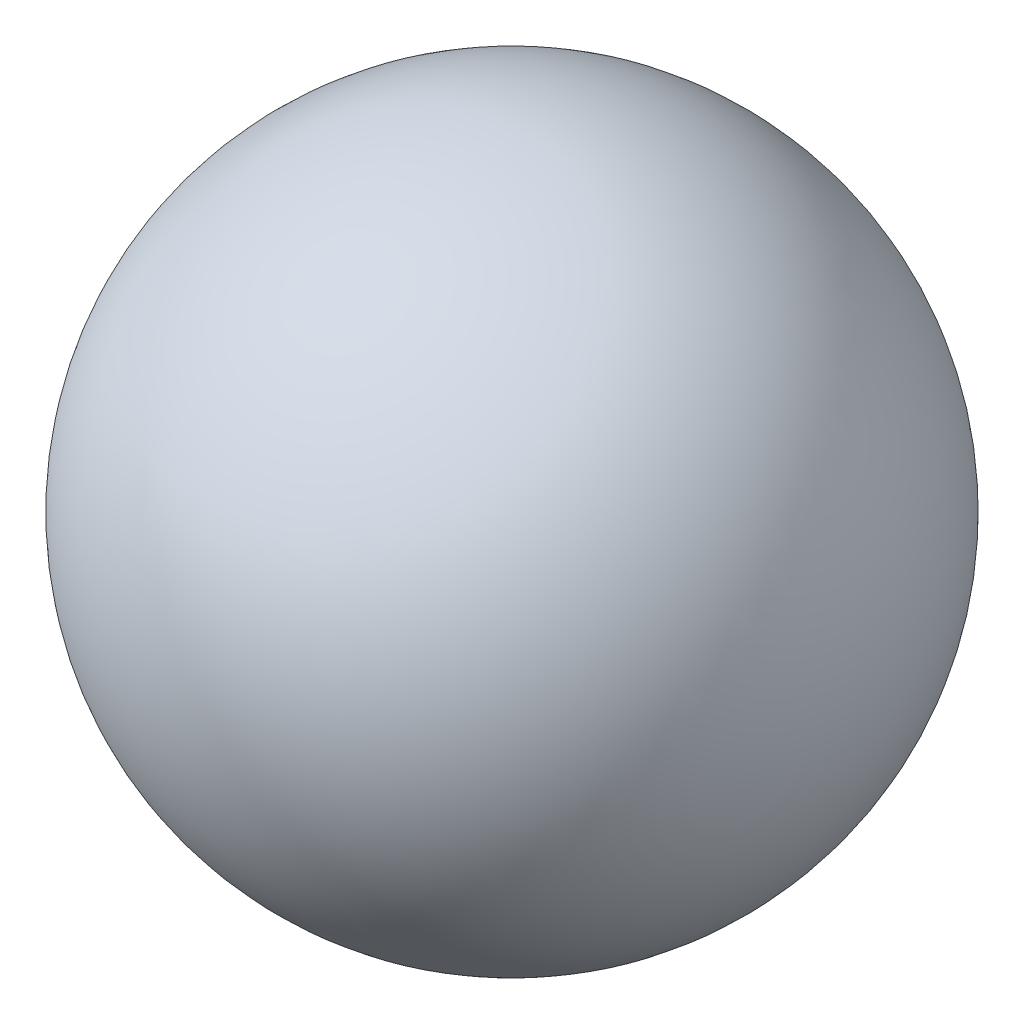
ISO-10303-21;
HEADER;
FILE_DESCRIPTION(('STEP AP214'),'2;1');
FILE_NAME('part.step','',(''),(''),'','','');
FILE_SCHEMA(('AUTOMOTIVE_DESIGN { 1 0 10303 214 1 1 1 1 }'));
ENDSEC;
DATA;
#1=APPLICATION_CONTEXT('core data for automotive mechanical design processes');
#2=APPLICATION_PROTOCOL_DEFINITION('international standard','automotive_design',2000,#1);
#3=PRODUCT_CONTEXT('',#1,'mechanical');
#4=PRODUCT('Part','Part','',(#3));
#5=PRODUCT_RELATED_PRODUCT_CATEGORY('part','',(#4));
#6=PRODUCT_DEFINITION_FORMATION('','',#4);
#7=PRODUCT_DEFINITION_CONTEXT('part definition',#1,'design');
#8=PRODUCT_DEFINITION('design','',#6,#7);
#9=PRODUCT_DEFINITION_SHAPE('','',#8);
#10=(LENGTH_UNIT() NAMED_UNIT(*) SI_UNIT(.MILLI.,.METRE.));
#11=(NAMED_UNIT(*) PLANE_ANGLE_UNIT() SI_UNIT($,.RADIAN.));
#12=(NAMED_UNIT(*) SI_UNIT($,.STERADIAN.) SOLID_ANGLE_UNIT());
#13=UNCERTAINTY_MEASURE_WITH_UNIT(LENGTH_MEASURE(1.E-05),#10,'distance_accuracy_value','');
#14=(GEOMETRIC_REPRESENTATION_CONTEXT(3) GLOBAL_UNCERTAINTY_ASSIGNED_CONTEXT((#13)) GLOBAL_UNIT_ASSIGNED_CONTEXT((#10,
#11,#12)) REPRESENTATION_CONTEXT('',''));
#15=CARTESIAN_POINT('',(0.,0.,0.));
#16=DIRECTION('',(0.,0.,1.));
#17=DIRECTION('',(1.,0.,0.));
#18=AXIS2_PLACEMENT_3D('',#15,#16,#17);
#19=CARTESIAN_POINT('',(0.,0.,0.));
#20=DIRECTION('',(0.,-1.,0.));
#21=DIRECTION('',(-1.,0.,0.));
#22=AXIS2_PLACEMENT_3D('',#19,#20,#21);
#23=SPHERICAL_SURFACE('',#22,120.65);
#24=CARTESIAN_POINT('',(0.,-120.65,0.));
#25=VERTEX_POINT('',#24);
#26=VERTEX_LOOP('',#25);
#27=FACE_BOUND('',#26,.T.);
#28=ADVANCED_FACE('F26',(#27),#23,.T.);
#29=CLOSED_SHELL('',(#28));
#30=MANIFOLD_SOLID_BREP('B2',#29);
#31=ADVANCED_BREP_SHAPE_REPRESENTATION('',(#18,#30),#14);
#32=SHAPE_DEFINITION_REPRESENTATION(#9,#31);
ENDSEC;
END-ISO-10303-21;
